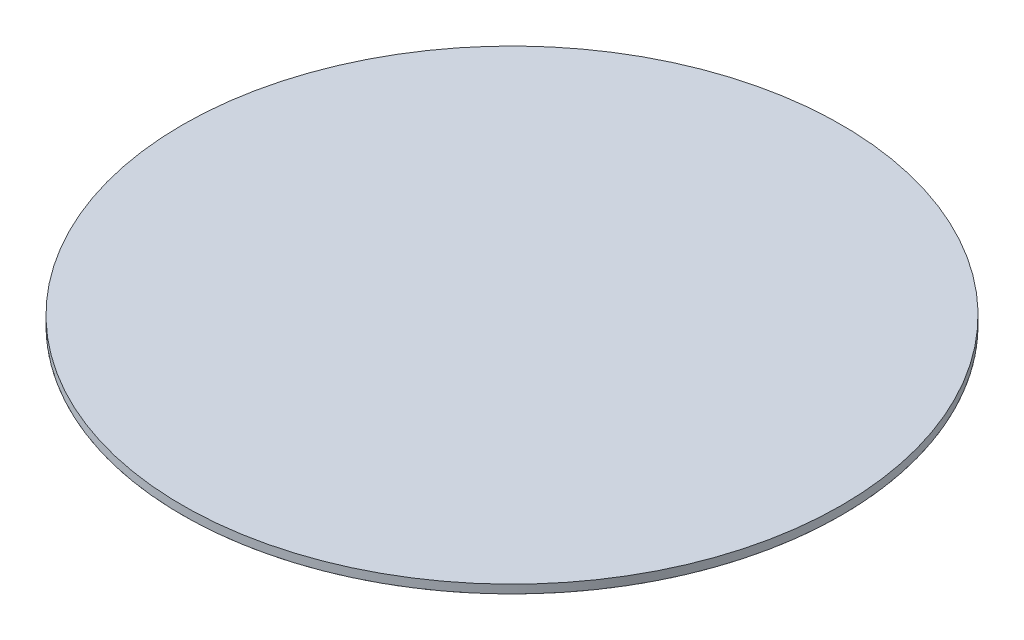
ISO-10303-21;
HEADER;
FILE_DESCRIPTION(('STEP AP214'),'2;1');
FILE_NAME('part.step','',(''),(''),'','','');
FILE_SCHEMA(('AUTOMOTIVE_DESIGN { 1 0 10303 214 1 1 1 1 }'));
ENDSEC;
DATA;
#1=APPLICATION_CONTEXT('core data for automotive mechanical design processes');
#2=APPLICATION_PROTOCOL_DEFINITION('international standard','automotive_design',2000,#1);
#3=PRODUCT_CONTEXT('',#1,'mechanical');
#4=PRODUCT('Part','Part','',(#3));
#5=PRODUCT_RELATED_PRODUCT_CATEGORY('part','',(#4));
#6=PRODUCT_DEFINITION_FORMATION('','',#4);
#7=PRODUCT_DEFINITION_CONTEXT('part definition',#1,'design');
#8=PRODUCT_DEFINITION('design','',#6,#7);
#9=PRODUCT_DEFINITION_SHAPE('','',#8);
#10=(LENGTH_UNIT() NAMED_UNIT(*) SI_UNIT(.MILLI.,.METRE.));
#11=(NAMED_UNIT(*) PLANE_ANGLE_UNIT() SI_UNIT($,.RADIAN.));
#12=(NAMED_UNIT(*) SI_UNIT($,.STERADIAN.) SOLID_ANGLE_UNIT());
#13=UNCERTAINTY_MEASURE_WITH_UNIT(LENGTH_MEASURE(1.E-05),#10,'distance_accuracy_value','');
#14=(GEOMETRIC_REPRESENTATION_CONTEXT(3) GLOBAL_UNCERTAINTY_ASSIGNED_CONTEXT((#13)) GLOBAL_UNIT_ASSIGNED_CONTEXT((#10,
#11,#12)) REPRESENTATION_CONTEXT('',''));
#15=CARTESIAN_POINT('',(0.,0.,0.));
#16=DIRECTION('',(0.,0.,1.));
#17=DIRECTION('',(1.,0.,0.));
#18=AXIS2_PLACEMENT_3D('',#15,#16,#17);
#19=CARTESIAN_POINT('',(0.,5.,0.));
#20=DIRECTION('',(0.,-1.,0.));
#21=DIRECTION('',(1.,0.,0.));
#22=AXIS2_PLACEMENT_3D('',#19,#20,#21);
#23=CYLINDRICAL_SURFACE('',#22,194.);
#24=CARTESIAN_POINT('',(0.,5.,0.));
#25=DIRECTION('',(0.,1.,0.));
#26=DIRECTION('',(-1.,0.,0.));
#27=AXIS2_PLACEMENT_3D('',#24,#25,#26);
#28=CIRCLE('',#27,194.);
#29=CARTESIAN_POINT('',(-194.,4.99999999999999,0.));
#30=VERTEX_POINT('',#29);
#31=EDGE_CURVE('E11',#30,#30,#28,.T.);
#32=ORIENTED_EDGE('',*,*,#31,.F.);
#33=EDGE_LOOP('',(#32));
#34=FACE_BOUND('',#33,.T.);
#35=CARTESIAN_POINT('',(0.,0.,0.));
#36=DIRECTION('',(0.,1.,0.));
#37=DIRECTION('',(-1.,0.,0.));
#38=AXIS2_PLACEMENT_3D('',#35,#36,#37);
#39=CIRCLE('',#38,194.);
#40=CARTESIAN_POINT('',(-194.,0.,0.));
#41=VERTEX_POINT('',#40);
#42=EDGE_CURVE('E50',#41,#41,#39,.T.);
#43=ORIENTED_EDGE('',*,*,#42,.T.);
#44=EDGE_LOOP('',(#43));
#45=FACE_BOUND('',#44,.T.);
#46=ADVANCED_FACE('F47',(#34,#45),#23,.T.);
#47=CARTESIAN_POINT('',(0.,5.,0.));
#48=DIRECTION('',(0.,1.,0.));
#49=DIRECTION('',(-1.,0.,0.));
#50=AXIS2_PLACEMENT_3D('',#47,#48,#49);
#51=PLANE('',#50);
#52=ORIENTED_EDGE('',*,*,#31,.T.);
#53=EDGE_LOOP('',(#52));
#54=FACE_BOUND('',#53,.T.);
#55=ADVANCED_FACE('F62',(#54),#51,.T.);
#56=CARTESIAN_POINT('',(0.,0.,0.));
#57=DIRECTION('',(0.,1.,0.));
#58=DIRECTION('',(-1.,0.,0.));
#59=AXIS2_PLACEMENT_3D('',#56,#57,#58);
#60=PLANE('',#59);
#61=ORIENTED_EDGE('',*,*,#42,.F.);
#62=EDGE_LOOP('',(#61));
#63=FACE_BOUND('',#62,.T.);
#64=ADVANCED_FACE('F60',(#63),#60,.F.);
#65=CLOSED_SHELL('',(#46,#55,#64));
#66=MANIFOLD_SOLID_BREP('B2',#65);
#67=CARTESIAN_POINT('',(0.,0.,-174.));
#68=CARTESIAN_POINT('',(0.,0.,-140.666666666667));
#69=CARTESIAN_POINT('',(0.,-9.99999999999999,-100.));
#70=CARTESIAN_POINT('',(0.,-10.,0.));
#71=B_SPLINE_CURVE_WITH_KNOTS('',3,(#67,#68,#69,#70),.UNSPECIFIED.,.F.,.F.,(4,4),(0.,1.),.UNSPECIFIED.);
#72=CARTESIAN_POINT('',(0.,0.,0.));
#73=DIRECTION('',(0.,-1.,0.));
#74=AXIS1_PLACEMENT('',#72,#73);
#75=SURFACE_OF_REVOLUTION('',#71,#74);
#76=CARTESIAN_POINT('',(0.,-10.,0.));
#77=VERTEX_POINT('',#76);
#78=VERTEX_LOOP('',#77);
#79=FACE_BOUND('',#78,.T.);
#80=CARTESIAN_POINT('',(0.,0.,0.));
#81=DIRECTION('',(0.,-1.,0.));
#82=DIRECTION('',(0.,0.,-1.));
#83=AXIS2_PLACEMENT_3D('',#80,#81,#82);
#84=CIRCLE('',#83,174.);
#85=CARTESIAN_POINT('',(0.,0.,-174.));
#86=VERTEX_POINT('',#85);
#87=EDGE_CURVE('E45',#86,#86,#84,.T.);
#88=ORIENTED_EDGE('',*,*,#87,.F.);
#89=EDGE_LOOP('',(#88));
#90=FACE_BOUND('',#89,.T.);
#91=ADVANCED_FACE('F87',(#79,#90),#75,.F.);
#92=CARTESIAN_POINT('',(0.,0.,-194.));
#93=DIRECTION('',(0.,1.,0.));
#94=DIRECTION('',(0.,0.,1.));
#95=AXIS2_PLACEMENT_3D('',#92,#93,#94);
#96=PLANE('',#95);
#97=ORIENTED_EDGE('',*,*,#87,.T.);
#98=EDGE_LOOP('',(#97));
#99=FACE_BOUND('',#98,.T.);
#100=CARTESIAN_POINT('',(0.,0.,0.));
#101=DIRECTION('',(0.,-1.,0.));
#102=DIRECTION('',(0.,0.,-1.));
#103=AXIS2_PLACEMENT_3D('',#100,#101,#102);
#104=CIRCLE('',#103,194.);
#105=CARTESIAN_POINT('',(0.,0.,-194.));
#106=VERTEX_POINT('',#105);
#107=EDGE_CURVE('E92',#106,#106,#104,.T.);
#108=ORIENTED_EDGE('',*,*,#107,.F.);
#109=EDGE_LOOP('',(#108));
#110=FACE_BOUND('',#109,.T.);
#111=ADVANCED_FACE('F97',(#99,#110),#96,.T.);
#112=OPEN_SHELL('',(#91,#111));
#113=SHELL_BASED_SURFACE_MODEL('B6',(#112));
#114=ADVANCED_BREP_SHAPE_REPRESENTATION('',(#18,#66),#14);
#115=MANIFOLD_SURFACE_SHAPE_REPRESENTATION('',(#18,#113),#14);
#116=SHAPE_REPRESENTATION('',(#18),#14);
#117=SHAPE_DEFINITION_REPRESENTATION(#9,#116);
#118=SHAPE_REPRESENTATION_RELATIONSHIP('','',#116,#114);
#119=SHAPE_REPRESENTATION_RELATIONSHIP('','',#116,#115);
ENDSEC;
END-ISO-10303-21;
